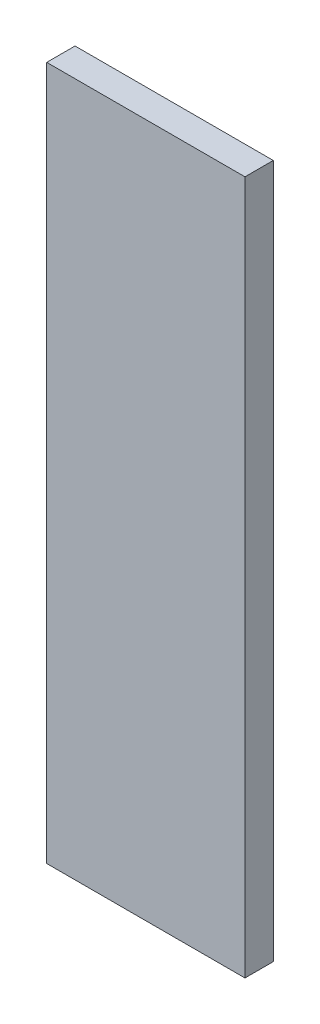
ISO-10303-21;
HEADER;
FILE_DESCRIPTION(('STEP AP214'),'2;1');
FILE_NAME('part.step','',(''),(''),'','','');
FILE_SCHEMA(('AUTOMOTIVE_DESIGN { 1 0 10303 214 1 1 1 1 }'));
ENDSEC;
DATA;
#1=APPLICATION_CONTEXT('core data for automotive mechanical design processes');
#2=APPLICATION_PROTOCOL_DEFINITION('international standard','automotive_design',2000,#1);
#3=PRODUCT_CONTEXT('',#1,'mechanical');
#4=PRODUCT('Part','Part','',(#3));
#5=PRODUCT_RELATED_PRODUCT_CATEGORY('part','',(#4));
#6=PRODUCT_DEFINITION_FORMATION('','',#4);
#7=PRODUCT_DEFINITION_CONTEXT('part definition',#1,'design');
#8=PRODUCT_DEFINITION('design','',#6,#7);
#9=PRODUCT_DEFINITION_SHAPE('','',#8);
#10=(LENGTH_UNIT() NAMED_UNIT(*) SI_UNIT(.MILLI.,.METRE.));
#11=(NAMED_UNIT(*) PLANE_ANGLE_UNIT() SI_UNIT($,.RADIAN.));
#12=(NAMED_UNIT(*) SI_UNIT($,.STERADIAN.) SOLID_ANGLE_UNIT());
#13=UNCERTAINTY_MEASURE_WITH_UNIT(LENGTH_MEASURE(1.E-05),#10,'distance_accuracy_value','');
#14=(GEOMETRIC_REPRESENTATION_CONTEXT(3) GLOBAL_UNCERTAINTY_ASSIGNED_CONTEXT((#13)) GLOBAL_UNIT_ASSIGNED_CONTEXT((#10,
#11,#12)) REPRESENTATION_CONTEXT('',''));
#15=CARTESIAN_POINT('',(0.,0.,0.));
#16=DIRECTION('',(0.,0.,1.));
#17=DIRECTION('',(1.,0.,0.));
#18=AXIS2_PLACEMENT_3D('',#15,#16,#17);
#19=CARTESIAN_POINT('',(-41.0170765027323,16.9166666666667,10.));
#20=DIRECTION('',(1.,0.,0.));
#21=DIRECTION('',(0.,1.,0.));
#22=AXIS2_PLACEMENT_3D('',#19,#20,#21);
#23=PLANE('',#22);
#24=DIRECTION('',(0.,-1.,0.));
#25=VECTOR('',#24,1.);
#26=CARTESIAN_POINT('',(-41.0170765027323,16.9166666666667,0.));
#27=LINE('',#26,#25);
#28=CARTESIAN_POINT('',(-41.0170765027323,16.9166666666667,0.));
#29=VERTEX_POINT('',#28);
#30=CARTESIAN_POINT('',(-41.0170765027322,-228.083333333333,0.));
#31=VERTEX_POINT('',#30);
#32=EDGE_CURVE('E96',#29,#31,#27,.T.);
#33=ORIENTED_EDGE('',*,*,#32,.T.);
#34=DIRECTION('',(0.,0.,-1.));
#35=VECTOR('',#34,1.);
#36=CARTESIAN_POINT('',(-41.0170765027322,-228.083333333333,10.));
#37=LINE('',#36,#35);
#38=CARTESIAN_POINT('',(-41.0170765027322,-228.083333333333,10.));
#39=VERTEX_POINT('',#38);
#40=EDGE_CURVE('E11',#39,#31,#37,.T.);
#41=ORIENTED_EDGE('',*,*,#40,.F.);
#42=DIRECTION('',(0.,-1.,0.));
#43=VECTOR('',#42,1.);
#44=CARTESIAN_POINT('',(-41.0170765027323,16.9166666666667,10.));
#45=LINE('',#44,#43);
#46=CARTESIAN_POINT('',(-41.0170765027323,16.9166666666667,10.));
#47=VERTEX_POINT('',#46);
#48=EDGE_CURVE('E84',#47,#39,#45,.T.);
#49=ORIENTED_EDGE('',*,*,#48,.F.);
#50=DIRECTION('',(0.,0.,-1.));
#51=VECTOR('',#50,1.);
#52=CARTESIAN_POINT('',(-41.0170765027323,16.9166666666667,10.));
#53=LINE('',#52,#51);
#54=EDGE_CURVE('E92',#47,#29,#53,.T.);
#55=ORIENTED_EDGE('',*,*,#54,.T.);
#56=EDGE_LOOP('',(#33,#41,#49,#55));
#57=FACE_BOUND('',#56,.T.);
#58=ADVANCED_FACE('F33',(#57),#23,.F.);
#59=CARTESIAN_POINT('',(-41.0170765027322,-228.083333333333,10.));
#60=DIRECTION('',(0.,1.,0.));
#61=DIRECTION('',(0.,0.,1.));
#62=AXIS2_PLACEMENT_3D('',#59,#60,#61);
#63=PLANE('',#62);
#64=DIRECTION('',(1.,0.,0.));
#65=VECTOR('',#64,1.);
#66=CARTESIAN_POINT('',(-41.0170765027322,-228.083333333333,0.));
#67=LINE('',#66,#65);
#68=CARTESIAN_POINT('',(28.9829234972678,-228.083333333333,0.));
#69=VERTEX_POINT('',#68);
#70=EDGE_CURVE('E88',#31,#69,#67,.T.);
#71=ORIENTED_EDGE('',*,*,#70,.T.);
#72=DIRECTION('',(0.,0.,-1.));
#73=VECTOR('',#72,1.);
#74=CARTESIAN_POINT('',(28.9829234972678,-228.083333333333,10.));
#75=LINE('',#74,#73);
#76=CARTESIAN_POINT('',(28.9829234972678,-228.083333333333,10.));
#77=VERTEX_POINT('',#76);
#78=EDGE_CURVE('E41',#77,#69,#75,.T.);
#79=ORIENTED_EDGE('',*,*,#78,.F.);
#80=DIRECTION('',(1.,0.,0.));
#81=VECTOR('',#80,1.);
#82=CARTESIAN_POINT('',(-41.0170765027322,-228.083333333333,10.));
#83=LINE('',#82,#81);
#84=EDGE_CURVE('E79',#39,#77,#83,.T.);
#85=ORIENTED_EDGE('',*,*,#84,.F.);
#86=ORIENTED_EDGE('',*,*,#40,.T.);
#87=EDGE_LOOP('',(#71,#79,#85,#86));
#88=FACE_BOUND('',#87,.T.);
#89=ADVANCED_FACE('F87',(#88),#63,.F.);
#90=CARTESIAN_POINT('',(28.9829234972677,16.9166666666667,10.));
#91=DIRECTION('',(-1.,0.,0.));
#92=DIRECTION('',(0.,-1.,0.));
#93=AXIS2_PLACEMENT_3D('',#90,#91,#92);
#94=PLANE('',#93);
#95=DIRECTION('',(0.,1.,0.));
#96=VECTOR('',#95,1.);
#97=CARTESIAN_POINT('',(28.9829234972677,16.9166666666667,0.));
#98=LINE('',#97,#96);
#99=CARTESIAN_POINT('',(28.9829234972677,16.9166666666667,0.));
#100=VERTEX_POINT('',#99);
#101=EDGE_CURVE('E66',#69,#100,#98,.T.);
#102=ORIENTED_EDGE('',*,*,#101,.T.);
#103=DIRECTION('',(0.,0.,-1.));
#104=VECTOR('',#103,1.);
#105=CARTESIAN_POINT('',(28.9829234972677,16.9166666666667,10.));
#106=LINE('',#105,#104);
#107=CARTESIAN_POINT('',(28.9829234972677,16.9166666666667,10.));
#108=VERTEX_POINT('',#107);
#109=EDGE_CURVE('E89',#108,#100,#106,.T.);
#110=ORIENTED_EDGE('',*,*,#109,.F.);
#111=DIRECTION('',(0.,1.,0.));
#112=VECTOR('',#111,1.);
#113=CARTESIAN_POINT('',(28.9829234972677,16.9166666666667,10.));
#114=LINE('',#113,#112);
#115=EDGE_CURVE('E82',#77,#108,#114,.T.);
#116=ORIENTED_EDGE('',*,*,#115,.F.);
#117=ORIENTED_EDGE('',*,*,#78,.T.);
#118=EDGE_LOOP('',(#102,#110,#116,#117));
#119=FACE_BOUND('',#118,.T.);
#120=ADVANCED_FACE('F90',(#119),#94,.F.);
#121=CARTESIAN_POINT('',(-41.0170765027323,16.9166666666667,10.));
#122=DIRECTION('',(0.,-1.,0.));
#123=DIRECTION('',(0.,0.,-1.));
#124=AXIS2_PLACEMENT_3D('',#121,#122,#123);
#125=PLANE('',#124);
#126=DIRECTION('',(-1.,0.,0.));
#127=VECTOR('',#126,1.);
#128=CARTESIAN_POINT('',(-41.0170765027323,16.9166666666667,0.));
#129=LINE('',#128,#127);
#130=EDGE_CURVE('E72',#100,#29,#129,.T.);
#131=ORIENTED_EDGE('',*,*,#130,.T.);
#132=ORIENTED_EDGE('',*,*,#54,.F.);
#133=DIRECTION('',(-1.,0.,0.));
#134=VECTOR('',#133,1.);
#135=CARTESIAN_POINT('',(-41.0170765027323,16.9166666666667,10.));
#136=LINE('',#135,#134);
#137=EDGE_CURVE('E49',#108,#47,#136,.T.);
#138=ORIENTED_EDGE('',*,*,#137,.F.);
#139=ORIENTED_EDGE('',*,*,#109,.T.);
#140=EDGE_LOOP('',(#131,#132,#138,#139));
#141=FACE_BOUND('',#140,.T.);
#142=ADVANCED_FACE('F103',(#141),#125,.F.);
#143=CARTESIAN_POINT('',(0.,0.,10.));
#144=DIRECTION('',(0.,0.,1.));
#145=DIRECTION('',(1.,0.,0.));
#146=AXIS2_PLACEMENT_3D('',#143,#144,#145);
#147=PLANE('',#146);
#148=ORIENTED_EDGE('',*,*,#48,.T.);
#149=ORIENTED_EDGE('',*,*,#84,.T.);
#150=ORIENTED_EDGE('',*,*,#115,.T.);
#151=ORIENTED_EDGE('',*,*,#137,.T.);
#152=EDGE_LOOP('',(#148,#149,#150,#151));
#153=FACE_BOUND('',#152,.T.);
#154=ADVANCED_FACE('F80',(#153),#147,.T.);
#155=CARTESIAN_POINT('',(0.,0.,0.));
#156=DIRECTION('',(0.,0.,1.));
#157=DIRECTION('',(1.,0.,0.));
#158=AXIS2_PLACEMENT_3D('',#155,#156,#157);
#159=PLANE('',#158);
#160=ORIENTED_EDGE('',*,*,#32,.F.);
#161=ORIENTED_EDGE('',*,*,#130,.F.);
#162=ORIENTED_EDGE('',*,*,#101,.F.);
#163=ORIENTED_EDGE('',*,*,#70,.F.);
#164=EDGE_LOOP('',(#160,#161,#162,#163));
#165=FACE_BOUND('',#164,.T.);
#166=ADVANCED_FACE('F106',(#165),#159,.F.);
#167=CLOSED_SHELL('',(#58,#89,#120,#142,#154,#166));
#168=MANIFOLD_SOLID_BREP('B2',#167);
#169=ADVANCED_BREP_SHAPE_REPRESENTATION('',(#18,#168),#14);
#170=SHAPE_DEFINITION_REPRESENTATION(#9,#169);
ENDSEC;
END-ISO-10303-21;
